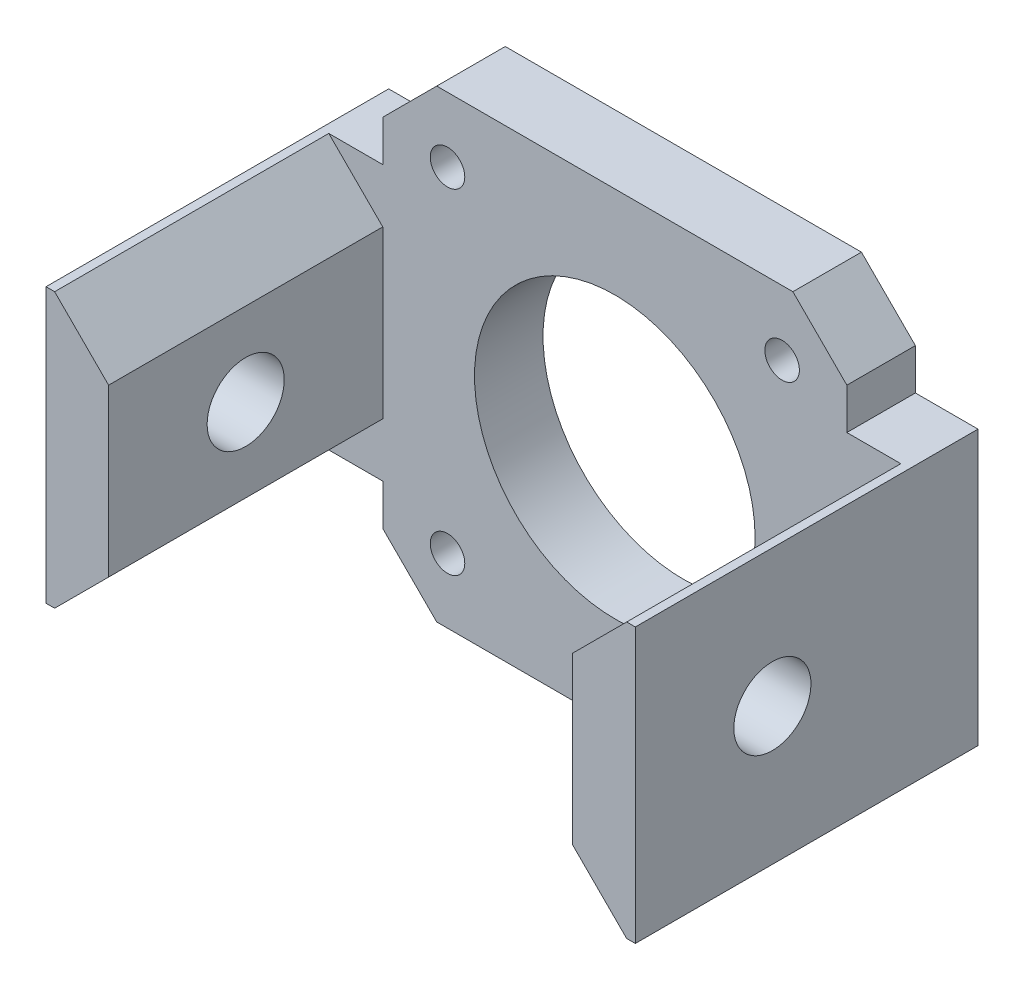
ISO-10303-21;
HEADER;
FILE_DESCRIPTION(('STEP AP214'),'2;1');
FILE_NAME('part.step','',(''),(''),'','','');
FILE_SCHEMA(('AUTOMOTIVE_DESIGN { 1 0 10303 214 1 1 1 1 }'));
ENDSEC;
DATA;
#1=APPLICATION_CONTEXT('core data for automotive mechanical design processes');
#2=APPLICATION_PROTOCOL_DEFINITION('international standard','automotive_design',2000,#1);
#3=PRODUCT_CONTEXT('',#1,'mechanical');
#4=PRODUCT('Part','Part','',(#3));
#5=PRODUCT_RELATED_PRODUCT_CATEGORY('part','',(#4));
#6=PRODUCT_DEFINITION_FORMATION('','',#4);
#7=PRODUCT_DEFINITION_CONTEXT('part definition',#1,'design');
#8=PRODUCT_DEFINITION('design','',#6,#7);
#9=PRODUCT_DEFINITION_SHAPE('','',#8);
#10=(LENGTH_UNIT() NAMED_UNIT(*) SI_UNIT(.MILLI.,.METRE.));
#11=(NAMED_UNIT(*) PLANE_ANGLE_UNIT() SI_UNIT($,.RADIAN.));
#12=(NAMED_UNIT(*) SI_UNIT($,.STERADIAN.) SOLID_ANGLE_UNIT());
#13=UNCERTAINTY_MEASURE_WITH_UNIT(LENGTH_MEASURE(1.E-05),#10,'distance_accuracy_value','');
#14=(GEOMETRIC_REPRESENTATION_CONTEXT(3) GLOBAL_UNCERTAINTY_ASSIGNED_CONTEXT((#13)) GLOBAL_UNIT_ASSIGNED_CONTEXT((#10,
#11,#12)) REPRESENTATION_CONTEXT('',''));
#15=CARTESIAN_POINT('',(0.,0.,0.));
#16=DIRECTION('',(0.,0.,1.));
#17=DIRECTION('',(1.,0.,0.));
#18=AXIS2_PLACEMENT_3D('',#15,#16,#17);
#19=CARTESIAN_POINT('',(0.,0.,6.35));
#20=DIRECTION('',(0.,0.,1.));
#21=DIRECTION('',(1.,0.,0.));
#22=AXIS2_PLACEMENT_3D('',#19,#20,#21);
#23=PLANE('',#22);
#24=DIRECTION('',(-0.707106781186547,-0.707106781186548,0.));
#25=VECTOR('',#24,1.);
#26=CARTESIAN_POINT('',(19.,-19.,6.35));
#27=LINE('',#26,#25);
#28=CARTESIAN_POINT('',(21.5,-16.5,6.35));
#29=VERTEX_POINT('',#28);
#30=CARTESIAN_POINT('',(16.5,-21.5,6.35));
#31=VERTEX_POINT('',#30);
#32=EDGE_CURVE('E355',#29,#31,#27,.T.);
#33=ORIENTED_EDGE('',*,*,#32,.F.);
#34=DIRECTION('',(0.,1.,0.));
#35=VECTOR('',#34,1.);
#36=CARTESIAN_POINT('',(21.5,0.,6.35));
#37=LINE('',#36,#35);
#38=CARTESIAN_POINT('',(21.5,-12.7,6.35));
#39=VERTEX_POINT('',#38);
#40=EDGE_CURVE('E349',#29,#39,#37,.T.);
#41=ORIENTED_EDGE('',*,*,#40,.T.);
#42=DIRECTION('',(-1.,0.,0.));
#43=VECTOR('',#42,1.);
#44=CARTESIAN_POINT('',(0.,-12.7,6.35));
#45=LINE('',#44,#43);
#46=CARTESIAN_POINT('',(26.5,-12.7,6.35));
#47=VERTEX_POINT('',#46);
#48=EDGE_CURVE('E444',#47,#39,#45,.T.);
#49=ORIENTED_EDGE('',*,*,#48,.F.);
#50=DIRECTION('',(0.707106781186549,-0.707106781186547,0.));
#51=VECTOR('',#50,1.);
#52=CARTESIAN_POINT('',(21.5,-7.7,6.35));
#53=LINE('',#52,#51);
#54=CARTESIAN_POINT('',(21.5,-7.7,6.35));
#55=VERTEX_POINT('',#54);
#56=EDGE_CURVE('E471',#47,#55,#53,.F.);
#57=ORIENTED_EDGE('',*,*,#56,.T.);
#58=DIRECTION('',(0.,-1.,0.));
#59=VECTOR('',#58,1.);
#60=CARTESIAN_POINT('',(21.5,-21.5,6.35));
#61=LINE('',#60,#59);
#62=CARTESIAN_POINT('',(21.5,7.69999999999999,6.35));
#63=VERTEX_POINT('',#62);
#64=EDGE_CURVE('E366',#63,#55,#61,.T.);
#65=ORIENTED_EDGE('',*,*,#64,.F.);
#66=DIRECTION('',(0.707106781186547,0.707106781186549,0.));
#67=VECTOR('',#66,1.);
#68=CARTESIAN_POINT('',(26.5,12.7,6.35));
#69=LINE('',#68,#67);
#70=CARTESIAN_POINT('',(26.5,12.7,6.35));
#71=VERTEX_POINT('',#70);
#72=EDGE_CURVE('E473',#63,#71,#69,.T.);
#73=ORIENTED_EDGE('',*,*,#72,.T.);
#74=DIRECTION('',(1.,0.,0.));
#75=VECTOR('',#74,1.);
#76=CARTESIAN_POINT('',(27.3,12.7,6.35));
#77=LINE('',#76,#75);
#78=CARTESIAN_POINT('',(21.5,12.7,6.35));
#79=VERTEX_POINT('',#78);
#80=EDGE_CURVE('E108',#79,#71,#77,.T.);
#81=ORIENTED_EDGE('',*,*,#80,.F.);
#82=DIRECTION('',(0.,-1.,0.));
#83=VECTOR('',#82,1.);
#84=CARTESIAN_POINT('',(21.5,0.,6.35));
#85=LINE('',#84,#83);
#86=CARTESIAN_POINT('',(21.5,16.5,6.35));
#87=VERTEX_POINT('',#86);
#88=EDGE_CURVE('E340',#87,#79,#85,.T.);
#89=ORIENTED_EDGE('',*,*,#88,.F.);
#90=DIRECTION('',(-0.707106781186547,0.707106781186548,0.));
#91=VECTOR('',#90,1.);
#92=CARTESIAN_POINT('',(19.,19.,6.35));
#93=LINE('',#92,#91);
#94=CARTESIAN_POINT('',(16.5,21.5,6.35));
#95=VERTEX_POINT('',#94);
#96=EDGE_CURVE('E352',#87,#95,#93,.T.);
#97=ORIENTED_EDGE('',*,*,#96,.T.);
#98=DIRECTION('',(-1.,0.,0.));
#99=VECTOR('',#98,1.);
#100=CARTESIAN_POINT('',(-21.5,21.5,6.35));
#101=LINE('',#100,#99);
#102=CARTESIAN_POINT('',(-16.5,21.5,6.35));
#103=VERTEX_POINT('',#102);
#104=EDGE_CURVE('E415',#95,#103,#101,.T.);
#105=ORIENTED_EDGE('',*,*,#104,.T.);
#106=DIRECTION('',(0.707106781186547,0.707106781186548,0.));
#107=VECTOR('',#106,1.);
#108=CARTESIAN_POINT('',(-19.,19.,6.35));
#109=LINE('',#108,#107);
#110=CARTESIAN_POINT('',(-21.5,16.5,6.35));
#111=VERTEX_POINT('',#110);
#112=EDGE_CURVE('E364',#111,#103,#109,.T.);
#113=ORIENTED_EDGE('',*,*,#112,.F.);
#114=DIRECTION('',(0.,-1.,0.));
#115=VECTOR('',#114,1.);
#116=CARTESIAN_POINT('',(-21.5,0.,6.35));
#117=LINE('',#116,#115);
#118=CARTESIAN_POINT('',(-21.5,12.7,6.35));
#119=VERTEX_POINT('',#118);
#120=EDGE_CURVE('E358',#111,#119,#117,.T.);
#121=ORIENTED_EDGE('',*,*,#120,.T.);
#122=DIRECTION('',(1.,0.,0.));
#123=VECTOR('',#122,1.);
#124=CARTESIAN_POINT('',(0.,12.7,6.35));
#125=LINE('',#124,#123);
#126=CARTESIAN_POINT('',(-26.5,12.7,6.35));
#127=VERTEX_POINT('',#126);
#128=EDGE_CURVE('E466',#127,#119,#125,.T.);
#129=ORIENTED_EDGE('',*,*,#128,.F.);
#130=DIRECTION('',(-0.707106781186549,0.707106781186547,0.));
#131=VECTOR('',#130,1.);
#132=CARTESIAN_POINT('',(-21.5,7.7,6.35));
#133=LINE('',#132,#131);
#134=CARTESIAN_POINT('',(-21.5,7.7,6.35));
#135=VERTEX_POINT('',#134);
#136=EDGE_CURVE('E12',#127,#135,#133,.F.);
#137=ORIENTED_EDGE('',*,*,#136,.T.);
#138=DIRECTION('',(0.,1.,0.));
#139=VECTOR('',#138,1.);
#140=CARTESIAN_POINT('',(-21.5,21.5,6.35));
#141=LINE('',#140,#139);
#142=CARTESIAN_POINT('',(-21.5,-7.69999999999998,6.35));
#143=VERTEX_POINT('',#142);
#144=EDGE_CURVE('E373',#143,#135,#141,.T.);
#145=ORIENTED_EDGE('',*,*,#144,.F.);
#146=DIRECTION('',(-0.707106781186547,-0.707106781186549,0.));
#147=VECTOR('',#146,1.);
#148=CARTESIAN_POINT('',(-26.5,-12.7,6.35));
#149=LINE('',#148,#147);
#150=CARTESIAN_POINT('',(-26.5,-12.7,6.35));
#151=VERTEX_POINT('',#150);
#152=EDGE_CURVE('E94',#143,#151,#149,.T.);
#153=ORIENTED_EDGE('',*,*,#152,.T.);
#154=DIRECTION('',(-1.,0.,0.));
#155=VECTOR('',#154,1.);
#156=CARTESIAN_POINT('',(-27.3,-12.7,6.35));
#157=LINE('',#156,#155);
#158=CARTESIAN_POINT('',(-21.5,-12.7,6.35));
#159=VERTEX_POINT('',#158);
#160=EDGE_CURVE('E101',#159,#151,#157,.T.);
#161=ORIENTED_EDGE('',*,*,#160,.F.);
#162=DIRECTION('',(0.,1.,0.));
#163=VECTOR('',#162,1.);
#164=CARTESIAN_POINT('',(-21.5,0.,6.35));
#165=LINE('',#164,#163);
#166=CARTESIAN_POINT('',(-21.5,-16.5,6.35));
#167=VERTEX_POINT('',#166);
#168=EDGE_CURVE('E265',#167,#159,#165,.T.);
#169=ORIENTED_EDGE('',*,*,#168,.F.);
#170=DIRECTION('',(0.707106781186547,-0.707106781186548,0.));
#171=VECTOR('',#170,1.);
#172=CARTESIAN_POINT('',(-19.,-19.,6.35));
#173=LINE('',#172,#171);
#174=CARTESIAN_POINT('',(-16.5,-21.5,6.35));
#175=VERTEX_POINT('',#174);
#176=EDGE_CURVE('E361',#167,#175,#173,.T.);
#177=ORIENTED_EDGE('',*,*,#176,.T.);
#178=DIRECTION('',(1.,0.,0.));
#179=VECTOR('',#178,1.);
#180=CARTESIAN_POINT('',(-21.5,-21.5,6.35));
#181=LINE('',#180,#179);
#182=EDGE_CURVE('E418',#175,#31,#181,.T.);
#183=ORIENTED_EDGE('',*,*,#182,.T.);
#184=EDGE_LOOP('',(#33,#41,#49,#57,#65,#73,#81,#89,#97,#105,#113,#121,#129,#137,#145,#153,#161,
#169,#177,#183));
#185=FACE_BOUND('',#184,.T.);
#186=CARTESIAN_POINT('',(15.5000000000002,-15.5000000000002,6.35));
#187=DIRECTION('',(0.,0.,1.));
#188=DIRECTION('',(1.,0.,0.));
#189=AXIS2_PLACEMENT_3D('',#186,#187,#188);
#190=CIRCLE('',#189,1.60000000000012);
#191=CARTESIAN_POINT('',(17.1000000000003,-15.5000000000002,6.35));
#192=VERTEX_POINT('',#191);
#193=EDGE_CURVE('E391',#192,#192,#190,.T.);
#194=ORIENTED_EDGE('',*,*,#193,.F.);
#195=EDGE_LOOP('',(#194));
#196=FACE_BOUND('',#195,.T.);
#197=CARTESIAN_POINT('',(-15.5000000000002,15.4999999999999,6.35));
#198=DIRECTION('',(0.,0.,1.));
#199=DIRECTION('',(1.,0.,0.));
#200=AXIS2_PLACEMENT_3D('',#197,#198,#199);
#201=CIRCLE('',#200,1.60000000000008);
#202=CARTESIAN_POINT('',(-13.9000000000001,15.4999999999999,6.35));
#203=VERTEX_POINT('',#202);
#204=EDGE_CURVE('E403',#203,#203,#201,.T.);
#205=ORIENTED_EDGE('',*,*,#204,.F.);
#206=EDGE_LOOP('',(#205));
#207=FACE_BOUND('',#206,.T.);
#208=CARTESIAN_POINT('',(0.,0.,6.35));
#209=DIRECTION('',(0.,0.,1.));
#210=DIRECTION('',(1.,0.,0.));
#211=AXIS2_PLACEMENT_3D('',#208,#209,#210);
#212=CIRCLE('',#211,13.);
#213=CARTESIAN_POINT('',(13.,0.,6.35));
#214=VERTEX_POINT('',#213);
#215=EDGE_CURVE('E409',#214,#214,#212,.T.);
#216=ORIENTED_EDGE('',*,*,#215,.F.);
#217=EDGE_LOOP('',(#216));
#218=FACE_BOUND('',#217,.T.);
#219=CARTESIAN_POINT('',(15.4999999999999,15.4999999999999,6.35));
#220=DIRECTION('',(0.,0.,1.));
#221=DIRECTION('',(1.,0.,0.));
#222=AXIS2_PLACEMENT_3D('',#219,#220,#221);
#223=CIRCLE('',#222,1.60000000000001);
#224=CARTESIAN_POINT('',(17.0999999999999,15.4999999999999,6.35));
#225=VERTEX_POINT('',#224);
#226=EDGE_CURVE('E397',#225,#225,#223,.T.);
#227=ORIENTED_EDGE('',*,*,#226,.F.);
#228=EDGE_LOOP('',(#227));
#229=FACE_BOUND('',#228,.T.);
#230=CARTESIAN_POINT('',(-15.5000000000001,-15.5000000000002,6.35));
#231=DIRECTION('',(0.,0.,1.));
#232=DIRECTION('',(1.,0.,0.));
#233=AXIS2_PLACEMENT_3D('',#230,#231,#232);
#234=CIRCLE('',#233,1.6);
#235=CARTESIAN_POINT('',(-13.9000000000001,-15.5000000000002,6.35));
#236=VERTEX_POINT('',#235);
#237=EDGE_CURVE('E385',#236,#236,#234,.T.);
#238=ORIENTED_EDGE('',*,*,#237,.F.);
#239=EDGE_LOOP('',(#238));
#240=FACE_BOUND('',#239,.T.);
#241=ADVANCED_FACE('F86',(#185,#196,#207,#218,#229,#240),#23,.T.);
#242=CARTESIAN_POINT('',(0.,0.,0.));
#243=DIRECTION('',(0.,0.,1.));
#244=DIRECTION('',(1.,0.,0.));
#245=AXIS2_PLACEMENT_3D('',#242,#243,#244);
#246=PLANE('',#245);
#247=CARTESIAN_POINT('',(0.,0.,0.));
#248=DIRECTION('',(0.,0.,1.));
#249=DIRECTION('',(1.,0.,0.));
#250=AXIS2_PLACEMENT_3D('',#247,#248,#249);
#251=CIRCLE('',#250,13.);
#252=CARTESIAN_POINT('',(13.,0.,0.));
#253=VERTEX_POINT('',#252);
#254=EDGE_CURVE('E406',#253,#253,#251,.T.);
#255=ORIENTED_EDGE('',*,*,#254,.T.);
#256=EDGE_LOOP('',(#255));
#257=FACE_BOUND('',#256,.T.);
#258=CARTESIAN_POINT('',(-15.5000000000002,15.4999999999999,0.));
#259=DIRECTION('',(0.,0.,1.));
#260=DIRECTION('',(1.,0.,0.));
#261=AXIS2_PLACEMENT_3D('',#258,#259,#260);
#262=CIRCLE('',#261,1.60000000000008);
#263=CARTESIAN_POINT('',(-13.9000000000001,15.4999999999999,0.));
#264=VERTEX_POINT('',#263);
#265=EDGE_CURVE('E400',#264,#264,#262,.T.);
#266=ORIENTED_EDGE('',*,*,#265,.T.);
#267=EDGE_LOOP('',(#266));
#268=FACE_BOUND('',#267,.T.);
#269=CARTESIAN_POINT('',(15.4999999999999,15.4999999999999,0.));
#270=DIRECTION('',(0.,0.,1.));
#271=DIRECTION('',(1.,0.,0.));
#272=AXIS2_PLACEMENT_3D('',#269,#270,#271);
#273=CIRCLE('',#272,1.60000000000001);
#274=CARTESIAN_POINT('',(17.0999999999999,15.4999999999999,0.));
#275=VERTEX_POINT('',#274);
#276=EDGE_CURVE('E394',#275,#275,#273,.T.);
#277=ORIENTED_EDGE('',*,*,#276,.T.);
#278=EDGE_LOOP('',(#277));
#279=FACE_BOUND('',#278,.T.);
#280=CARTESIAN_POINT('',(15.5000000000002,-15.5000000000002,0.));
#281=DIRECTION('',(0.,0.,1.));
#282=DIRECTION('',(1.,0.,0.));
#283=AXIS2_PLACEMENT_3D('',#280,#281,#282);
#284=CIRCLE('',#283,1.60000000000012);
#285=CARTESIAN_POINT('',(17.1000000000003,-15.5000000000002,0.));
#286=VERTEX_POINT('',#285);
#287=EDGE_CURVE('E388',#286,#286,#284,.T.);
#288=ORIENTED_EDGE('',*,*,#287,.T.);
#289=EDGE_LOOP('',(#288));
#290=FACE_BOUND('',#289,.T.);
#291=CARTESIAN_POINT('',(-15.5000000000001,-15.5000000000002,0.));
#292=DIRECTION('',(0.,0.,1.));
#293=DIRECTION('',(1.,0.,0.));
#294=AXIS2_PLACEMENT_3D('',#291,#292,#293);
#295=CIRCLE('',#294,1.6);
#296=CARTESIAN_POINT('',(-13.9000000000001,-15.5000000000002,0.));
#297=VERTEX_POINT('',#296);
#298=EDGE_CURVE('E382',#297,#297,#295,.T.);
#299=ORIENTED_EDGE('',*,*,#298,.T.);
#300=EDGE_LOOP('',(#299));
#301=FACE_BOUND('',#300,.T.);
#302=DIRECTION('',(0.,1.,0.));
#303=VECTOR('',#302,1.);
#304=CARTESIAN_POINT('',(21.5,-16.5,0.));
#305=LINE('',#304,#303);
#306=CARTESIAN_POINT('',(21.5,-16.5,0.));
#307=VERTEX_POINT('',#306);
#308=CARTESIAN_POINT('',(21.5,-12.7,0.));
#309=VERTEX_POINT('',#308);
#310=EDGE_CURVE('E298',#307,#309,#305,.T.);
#311=ORIENTED_EDGE('',*,*,#310,.F.);
#312=DIRECTION('',(-0.707106781186547,-0.707106781186548,0.));
#313=VECTOR('',#312,1.);
#314=CARTESIAN_POINT('',(21.5,-16.5,0.));
#315=LINE('',#314,#313);
#316=CARTESIAN_POINT('',(16.5,-21.5,0.));
#317=VERTEX_POINT('',#316);
#318=EDGE_CURVE('E300',#307,#317,#315,.T.);
#319=ORIENTED_EDGE('',*,*,#318,.T.);
#320=DIRECTION('',(1.,0.,0.));
#321=VECTOR('',#320,1.);
#322=CARTESIAN_POINT('',(21.5,-21.5,0.));
#323=LINE('',#322,#321);
#324=CARTESIAN_POINT('',(-16.5,-21.5,0.));
#325=VERTEX_POINT('',#324);
#326=EDGE_CURVE('E424',#325,#317,#323,.T.);
#327=ORIENTED_EDGE('',*,*,#326,.F.);
#328=DIRECTION('',(0.707106781186547,-0.707106781186548,0.));
#329=VECTOR('',#328,1.);
#330=CARTESIAN_POINT('',(-19.,-19.,0.));
#331=LINE('',#330,#329);
#332=CARTESIAN_POINT('',(-21.5,-16.5,0.));
#333=VERTEX_POINT('',#332);
#334=EDGE_CURVE('E270',#333,#325,#331,.T.);
#335=ORIENTED_EDGE('',*,*,#334,.F.);
#336=DIRECTION('',(0.,1.,0.));
#337=VECTOR('',#336,1.);
#338=CARTESIAN_POINT('',(-21.5,-16.5,0.));
#339=LINE('',#338,#337);
#340=CARTESIAN_POINT('',(-21.5,-12.7,0.));
#341=VERTEX_POINT('',#340);
#342=EDGE_CURVE('E258',#333,#341,#339,.T.);
#343=ORIENTED_EDGE('',*,*,#342,.T.);
#344=DIRECTION('',(1.,0.,0.));
#345=VECTOR('',#344,1.);
#346=CARTESIAN_POINT('',(-27.3,-12.7,0.));
#347=LINE('',#346,#345);
#348=CARTESIAN_POINT('',(-27.3,-12.7,0.));
#349=VERTEX_POINT('',#348);
#350=EDGE_CURVE('E246',#349,#341,#347,.T.);
#351=ORIENTED_EDGE('',*,*,#350,.F.);
#352=DIRECTION('',(0.,-1.,0.));
#353=VECTOR('',#352,1.);
#354=CARTESIAN_POINT('',(-27.3,21.5,0.));
#355=LINE('',#354,#353);
#356=CARTESIAN_POINT('',(-27.3,12.7,0.));
#357=VERTEX_POINT('',#356);
#358=EDGE_CURVE('E412',#357,#349,#355,.T.);
#359=ORIENTED_EDGE('',*,*,#358,.F.);
#360=DIRECTION('',(1.,0.,0.));
#361=VECTOR('',#360,1.);
#362=CARTESIAN_POINT('',(-27.3,12.7,0.));
#363=LINE('',#362,#361);
#364=CARTESIAN_POINT('',(-21.5,12.7,0.));
#365=VERTEX_POINT('',#364);
#366=EDGE_CURVE('E320',#357,#365,#363,.T.);
#367=ORIENTED_EDGE('',*,*,#366,.T.);
#368=DIRECTION('',(0.,-1.,0.));
#369=VECTOR('',#368,1.);
#370=CARTESIAN_POINT('',(-21.5,16.5,0.));
#371=LINE('',#370,#369);
#372=CARTESIAN_POINT('',(-21.5,16.5,0.));
#373=VERTEX_POINT('',#372);
#374=EDGE_CURVE('E323',#373,#365,#371,.T.);
#375=ORIENTED_EDGE('',*,*,#374,.F.);
#376=DIRECTION('',(0.707106781186547,0.707106781186548,0.));
#377=VECTOR('',#376,1.);
#378=CARTESIAN_POINT('',(-21.5,16.5,0.));
#379=LINE('',#378,#377);
#380=CARTESIAN_POINT('',(-16.5,21.5,0.));
#381=VERTEX_POINT('',#380);
#382=EDGE_CURVE('E317',#373,#381,#379,.T.);
#383=ORIENTED_EDGE('',*,*,#382,.T.);
#384=DIRECTION('',(-1.,0.,0.));
#385=VECTOR('',#384,1.);
#386=CARTESIAN_POINT('',(-21.5,21.5,0.));
#387=LINE('',#386,#385);
#388=CARTESIAN_POINT('',(16.5,21.5,0.));
#389=VERTEX_POINT('',#388);
#390=EDGE_CURVE('E419',#389,#381,#387,.T.);
#391=ORIENTED_EDGE('',*,*,#390,.F.);
#392=DIRECTION('',(-0.707106781186547,0.707106781186548,0.));
#393=VECTOR('',#392,1.);
#394=CARTESIAN_POINT('',(21.5,16.5,0.));
#395=LINE('',#394,#393);
#396=CARTESIAN_POINT('',(21.5,16.5,0.));
#397=VERTEX_POINT('',#396);
#398=EDGE_CURVE('E329',#397,#389,#395,.T.);
#399=ORIENTED_EDGE('',*,*,#398,.F.);
#400=DIRECTION('',(0.,-1.,0.));
#401=VECTOR('',#400,1.);
#402=CARTESIAN_POINT('',(21.5,16.5,0.));
#403=LINE('',#402,#401);
#404=CARTESIAN_POINT('',(21.5,12.7,0.));
#405=VERTEX_POINT('',#404);
#406=EDGE_CURVE('E331',#397,#405,#403,.T.);
#407=ORIENTED_EDGE('',*,*,#406,.T.);
#408=DIRECTION('',(-1.,0.,0.));
#409=VECTOR('',#408,1.);
#410=CARTESIAN_POINT('',(27.3,12.7,0.));
#411=LINE('',#410,#409);
#412=CARTESIAN_POINT('',(27.3,12.7,0.));
#413=VERTEX_POINT('',#412);
#414=EDGE_CURVE('E334',#413,#405,#411,.T.);
#415=ORIENTED_EDGE('',*,*,#414,.F.);
#416=DIRECTION('',(0.,1.,0.));
#417=VECTOR('',#416,1.);
#418=CARTESIAN_POINT('',(27.3,-21.5,0.));
#419=LINE('',#418,#417);
#420=CARTESIAN_POINT('',(27.3,-12.7,0.));
#421=VERTEX_POINT('',#420);
#422=EDGE_CURVE('E427',#421,#413,#419,.T.);
#423=ORIENTED_EDGE('',*,*,#422,.F.);
#424=DIRECTION('',(-1.,0.,0.));
#425=VECTOR('',#424,1.);
#426=CARTESIAN_POINT('',(27.3,-12.7,0.));
#427=LINE('',#426,#425);
#428=EDGE_CURVE('E295',#421,#309,#427,.T.);
#429=ORIENTED_EDGE('',*,*,#428,.T.);
#430=EDGE_LOOP('',(#311,#319,#327,#335,#343,#351,#359,#367,#375,#383,#391,#399,#407,#415,#423,#429));
#431=FACE_BOUND('',#430,.T.);
#432=ADVANCED_FACE('F268',(#257,#268,#279,#290,#301,#431),#246,.F.);
#433=CARTESIAN_POINT('',(-27.3,21.5,6.35));
#434=DIRECTION('',(1.,0.,0.));
#435=DIRECTION('',(0.,1.,0.));
#436=AXIS2_PLACEMENT_3D('',#433,#434,#435);
#437=PLANE('',#436);
#438=CARTESIAN_POINT('',(-27.3,0.,19.05));
#439=DIRECTION('',(1.,0.,0.));
#440=DIRECTION('',(0.,1.,0.));
#441=AXIS2_PLACEMENT_3D('',#438,#439,#440);
#442=CIRCLE('',#441,3.571875);
#443=CARTESIAN_POINT('',(-27.3,3.571875,19.05));
#444=VERTEX_POINT('',#443);
#445=EDGE_CURVE('E435',#444,#444,#442,.T.);
#446=ORIENTED_EDGE('',*,*,#445,.T.);
#447=EDGE_LOOP('',(#446));
#448=FACE_BOUND('',#447,.T.);
#449=DIRECTION('',(0.,-1.,0.));
#450=VECTOR('',#449,1.);
#451=CARTESIAN_POINT('',(-27.3,-21.5,31.75));
#452=LINE('',#451,#450);
#453=CARTESIAN_POINT('',(-27.3,12.7,31.75));
#454=VERTEX_POINT('',#453);
#455=CARTESIAN_POINT('',(-27.3,-12.7,31.75));
#456=VERTEX_POINT('',#455);
#457=EDGE_CURVE('E376',#454,#456,#452,.T.);
#458=ORIENTED_EDGE('',*,*,#457,.F.);
#459=DIRECTION('',(0.,0.,1.));
#460=VECTOR('',#459,1.);
#461=CARTESIAN_POINT('',(-27.3,12.7,0.));
#462=LINE('',#461,#460);
#463=EDGE_CURVE('E309',#357,#454,#462,.T.);
#464=ORIENTED_EDGE('',*,*,#463,.F.);
#465=ORIENTED_EDGE('',*,*,#358,.T.);
#466=DIRECTION('',(0.,0.,1.));
#467=VECTOR('',#466,1.);
#468=CARTESIAN_POINT('',(-27.3,-12.7,0.));
#469=LINE('',#468,#467);
#470=EDGE_CURVE('E252',#349,#456,#469,.T.);
#471=ORIENTED_EDGE('',*,*,#470,.T.);
#472=EDGE_LOOP('',(#458,#464,#465,#471));
#473=FACE_BOUND('',#472,.T.);
#474=ADVANCED_FACE('F498',(#448,#473),#437,.F.);
#475=CARTESIAN_POINT('',(21.5,-21.5,6.35));
#476=DIRECTION('',(0.,1.,0.));
#477=DIRECTION('',(0.,0.,1.));
#478=AXIS2_PLACEMENT_3D('',#475,#476,#477);
#479=PLANE('',#478);
#480=ORIENTED_EDGE('',*,*,#326,.T.);
#481=DIRECTION('',(0.,0.,1.));
#482=VECTOR('',#481,1.);
#483=CARTESIAN_POINT('',(16.5,-21.5,0.));
#484=LINE('',#483,#482);
#485=EDGE_CURVE('E283',#317,#31,#484,.T.);
#486=ORIENTED_EDGE('',*,*,#485,.T.);
#487=ORIENTED_EDGE('',*,*,#182,.F.);
#488=DIRECTION('',(0.,0.,1.));
#489=VECTOR('',#488,1.);
#490=CARTESIAN_POINT('',(-16.5,-21.5,0.));
#491=LINE('',#490,#489);
#492=EDGE_CURVE('E279',#325,#175,#491,.T.);
#493=ORIENTED_EDGE('',*,*,#492,.F.);
#494=EDGE_LOOP('',(#480,#486,#487,#493));
#495=FACE_BOUND('',#494,.T.);
#496=ADVANCED_FACE('F573',(#495),#479,.F.);
#497=CARTESIAN_POINT('',(27.3,-21.5,6.35));
#498=DIRECTION('',(-1.,0.,0.));
#499=DIRECTION('',(0.,0.,1.));
#500=AXIS2_PLACEMENT_3D('',#497,#498,#499);
#501=PLANE('',#500);
#502=CARTESIAN_POINT('',(27.3,0.,19.05));
#503=DIRECTION('',(1.,0.,0.));
#504=DIRECTION('',(0.,1.,0.));
#505=AXIS2_PLACEMENT_3D('',#502,#503,#504);
#506=CIRCLE('',#505,3.571875);
#507=CARTESIAN_POINT('',(27.3,3.57187500000001,19.05));
#508=VERTEX_POINT('',#507);
#509=EDGE_CURVE('E896',#508,#508,#506,.T.);
#510=ORIENTED_EDGE('',*,*,#509,.F.);
#511=EDGE_LOOP('',(#510));
#512=FACE_BOUND('',#511,.T.);
#513=DIRECTION('',(0.,1.,0.));
#514=VECTOR('',#513,1.);
#515=CARTESIAN_POINT('',(27.3,21.5,31.75));
#516=LINE('',#515,#514);
#517=CARTESIAN_POINT('',(27.3,-12.7,31.75));
#518=VERTEX_POINT('',#517);
#519=CARTESIAN_POINT('',(27.3,12.7,31.75));
#520=VERTEX_POINT('',#519);
#521=EDGE_CURVE('E370',#518,#520,#516,.T.);
#522=ORIENTED_EDGE('',*,*,#521,.F.);
#523=DIRECTION('',(0.,0.,1.));
#524=VECTOR('',#523,1.);
#525=CARTESIAN_POINT('',(27.3,-12.7,0.));
#526=LINE('',#525,#524);
#527=EDGE_CURVE('E293',#421,#518,#526,.T.);
#528=ORIENTED_EDGE('',*,*,#527,.F.);
#529=ORIENTED_EDGE('',*,*,#422,.T.);
#530=DIRECTION('',(0.,0.,1.));
#531=VECTOR('',#530,1.);
#532=CARTESIAN_POINT('',(27.3,12.7,0.));
#533=LINE('',#532,#531);
#534=EDGE_CURVE('E337',#413,#520,#533,.T.);
#535=ORIENTED_EDGE('',*,*,#534,.T.);
#536=EDGE_LOOP('',(#522,#528,#529,#535));
#537=FACE_BOUND('',#536,.T.);
#538=ADVANCED_FACE('F524',(#512,#537),#501,.F.);
#539=CARTESIAN_POINT('',(-21.5,21.5,6.35));
#540=DIRECTION('',(0.,-1.,0.));
#541=DIRECTION('',(0.,0.,-1.));
#542=AXIS2_PLACEMENT_3D('',#539,#540,#541);
#543=PLANE('',#542);
#544=ORIENTED_EDGE('',*,*,#390,.T.);
#545=DIRECTION('',(0.,0.,1.));
#546=VECTOR('',#545,1.);
#547=CARTESIAN_POINT('',(-16.5,21.5,0.));
#548=LINE('',#547,#546);
#549=EDGE_CURVE('E311',#381,#103,#548,.T.);
#550=ORIENTED_EDGE('',*,*,#549,.T.);
#551=ORIENTED_EDGE('',*,*,#104,.F.);
#552=DIRECTION('',(0.,0.,1.));
#553=VECTOR('',#552,1.);
#554=CARTESIAN_POINT('',(16.5,21.5,0.));
#555=LINE('',#554,#553);
#556=EDGE_CURVE('E336',#389,#95,#555,.T.);
#557=ORIENTED_EDGE('',*,*,#556,.F.);
#558=EDGE_LOOP('',(#544,#550,#551,#557));
#559=FACE_BOUND('',#558,.T.);
#560=ADVANCED_FACE('F509',(#559),#543,.F.);
#561=CARTESIAN_POINT('',(-21.5,21.5,31.75));
#562=DIRECTION('',(-1.,0.,0.));
#563=DIRECTION('',(0.,-1.,0.));
#564=AXIS2_PLACEMENT_3D('',#561,#562,#563);
#565=PLANE('',#564);
#566=CARTESIAN_POINT('',(-21.5,0.,19.05));
#567=DIRECTION('',(-1.,0.,0.));
#568=DIRECTION('',(0.,-1.,0.));
#569=AXIS2_PLACEMENT_3D('',#566,#567,#568);
#570=CIRCLE('',#569,3.571875);
#571=CARTESIAN_POINT('',(-21.5,-3.571875,19.05));
#572=VERTEX_POINT('',#571);
#573=EDGE_CURVE('E281',#572,#572,#570,.T.);
#574=ORIENTED_EDGE('',*,*,#573,.T.);
#575=EDGE_LOOP('',(#574));
#576=FACE_BOUND('',#575,.T.);
#577=DIRECTION('',(0.,1.,0.));
#578=VECTOR('',#577,1.);
#579=CARTESIAN_POINT('',(-21.5,21.5,31.75));
#580=LINE('',#579,#578);
#581=CARTESIAN_POINT('',(-21.5,-7.69999999999998,31.75));
#582=VERTEX_POINT('',#581);
#583=CARTESIAN_POINT('',(-21.5,7.7,31.75));
#584=VERTEX_POINT('',#583);
#585=EDGE_CURVE('E379',#582,#584,#580,.T.);
#586=ORIENTED_EDGE('',*,*,#585,.F.);
#587=DIRECTION('',(0.,0.,-1.));
#588=VECTOR('',#587,1.);
#589=CARTESIAN_POINT('',(-21.5,-7.69999999999998,6.35));
#590=LINE('',#589,#588);
#591=EDGE_CURVE('E464',#582,#143,#590,.T.);
#592=ORIENTED_EDGE('',*,*,#591,.T.);
#593=ORIENTED_EDGE('',*,*,#144,.T.);
#594=DIRECTION('',(0.,0.,1.));
#595=VECTOR('',#594,1.);
#596=CARTESIAN_POINT('',(-21.5,7.7,31.75));
#597=LINE('',#596,#595);
#598=EDGE_CURVE('E461',#135,#584,#597,.T.);
#599=ORIENTED_EDGE('',*,*,#598,.T.);
#600=EDGE_LOOP('',(#586,#592,#593,#599));
#601=FACE_BOUND('',#600,.T.);
#602=ADVANCED_FACE('F486',(#576,#601),#565,.F.);
#603=CARTESIAN_POINT('',(0.,0.,31.75));
#604=DIRECTION('',(0.,0.,-1.));
#605=DIRECTION('',(-1.,0.,0.));
#606=AXIS2_PLACEMENT_3D('',#603,#604,#605);
#607=PLANE('',#606);
#608=DIRECTION('',(1.,0.,0.));
#609=VECTOR('',#608,1.);
#610=CARTESIAN_POINT('',(-27.3,-12.7,31.75));
#611=LINE('',#610,#609);
#612=CARTESIAN_POINT('',(-26.5,-12.7,31.75));
#613=VERTEX_POINT('',#612);
#614=EDGE_CURVE('E257',#456,#613,#611,.T.);
#615=ORIENTED_EDGE('',*,*,#614,.T.);
#616=DIRECTION('',(0.707106781186547,0.707106781186549,0.));
#617=VECTOR('',#616,1.);
#618=CARTESIAN_POINT('',(-26.5,-12.7,31.75));
#619=LINE('',#618,#617);
#620=EDGE_CURVE('E459',#613,#582,#619,.T.);
#621=ORIENTED_EDGE('',*,*,#620,.T.);
#622=ORIENTED_EDGE('',*,*,#585,.T.);
#623=DIRECTION('',(0.707106781186549,-0.707106781186547,0.));
#624=VECTOR('',#623,1.);
#625=CARTESIAN_POINT('',(-21.5,7.7,31.75));
#626=LINE('',#625,#624);
#627=CARTESIAN_POINT('',(-26.5,12.7,31.75));
#628=VERTEX_POINT('',#627);
#629=EDGE_CURVE('E457',#584,#628,#626,.F.);
#630=ORIENTED_EDGE('',*,*,#629,.T.);
#631=DIRECTION('',(1.,0.,0.));
#632=VECTOR('',#631,1.);
#633=CARTESIAN_POINT('',(-27.3,12.7,31.75));
#634=LINE('',#633,#632);
#635=EDGE_CURVE('E287',#454,#628,#634,.T.);
#636=ORIENTED_EDGE('',*,*,#635,.F.);
#637=ORIENTED_EDGE('',*,*,#457,.T.);
#638=EDGE_LOOP('',(#615,#621,#622,#630,#636,#637));
#639=FACE_BOUND('',#638,.T.);
#640=ADVANCED_FACE('F484',(#639),#607,.F.);
#641=CARTESIAN_POINT('',(21.5,-21.5,31.75));
#642=DIRECTION('',(1.,0.,0.));
#643=DIRECTION('',(0.,0.,-1.));
#644=AXIS2_PLACEMENT_3D('',#641,#642,#643);
#645=PLANE('',#644);
#646=CARTESIAN_POINT('',(21.5,0.,19.05));
#647=DIRECTION('',(1.,0.,0.));
#648=DIRECTION('',(0.,0.,-1.));
#649=AXIS2_PLACEMENT_3D('',#646,#647,#648);
#650=CIRCLE('',#649,3.571875);
#651=CARTESIAN_POINT('',(21.5,0.,15.478125));
#652=VERTEX_POINT('',#651);
#653=EDGE_CURVE('E432',#652,#652,#650,.T.);
#654=ORIENTED_EDGE('',*,*,#653,.T.);
#655=EDGE_LOOP('',(#654));
#656=FACE_BOUND('',#655,.T.);
#657=ORIENTED_EDGE('',*,*,#64,.T.);
#658=DIRECTION('',(0.,0.,1.));
#659=VECTOR('',#658,1.);
#660=CARTESIAN_POINT('',(21.5,-7.7,31.75));
#661=LINE('',#660,#659);
#662=CARTESIAN_POINT('',(21.5,-7.7,31.75));
#663=VERTEX_POINT('',#662);
#664=EDGE_CURVE('E437',#55,#663,#661,.T.);
#665=ORIENTED_EDGE('',*,*,#664,.T.);
#666=DIRECTION('',(0.,-1.,0.));
#667=VECTOR('',#666,1.);
#668=CARTESIAN_POINT('',(21.5,-21.5,31.75));
#669=LINE('',#668,#667);
#670=CARTESIAN_POINT('',(21.5,7.69999999999999,31.75));
#671=VERTEX_POINT('',#670);
#672=EDGE_CURVE('E367',#671,#663,#669,.T.);
#673=ORIENTED_EDGE('',*,*,#672,.F.);
#674=DIRECTION('',(0.,0.,-1.));
#675=VECTOR('',#674,1.);
#676=CARTESIAN_POINT('',(21.5,7.69999999999999,6.35));
#677=LINE('',#676,#675);
#678=EDGE_CURVE('E422',#671,#63,#677,.T.);
#679=ORIENTED_EDGE('',*,*,#678,.T.);
#680=EDGE_LOOP('',(#657,#665,#673,#679));
#681=FACE_BOUND('',#680,.T.);
#682=ADVANCED_FACE('F538',(#656,#681),#645,.F.);
#683=CARTESIAN_POINT('',(0.,0.,31.75));
#684=DIRECTION('',(0.,0.,-1.));
#685=DIRECTION('',(-1.,0.,0.));
#686=AXIS2_PLACEMENT_3D('',#683,#684,#685);
#687=PLANE('',#686);
#688=ORIENTED_EDGE('',*,*,#672,.T.);
#689=DIRECTION('',(-0.707106781186549,0.707106781186547,0.));
#690=VECTOR('',#689,1.);
#691=CARTESIAN_POINT('',(21.5,-7.7,31.75));
#692=LINE('',#691,#690);
#693=CARTESIAN_POINT('',(26.5,-12.7,31.75));
#694=VERTEX_POINT('',#693);
#695=EDGE_CURVE('E442',#663,#694,#692,.F.);
#696=ORIENTED_EDGE('',*,*,#695,.T.);
#697=DIRECTION('',(-1.,0.,0.));
#698=VECTOR('',#697,1.);
#699=CARTESIAN_POINT('',(27.3,-12.7,31.75));
#700=LINE('',#699,#698);
#701=EDGE_CURVE('E303',#518,#694,#700,.T.);
#702=ORIENTED_EDGE('',*,*,#701,.F.);
#703=ORIENTED_EDGE('',*,*,#521,.T.);
#704=DIRECTION('',(-1.,0.,0.));
#705=VECTOR('',#704,1.);
#706=CARTESIAN_POINT('',(27.3,12.7,31.75));
#707=LINE('',#706,#705);
#708=CARTESIAN_POINT('',(26.5,12.7,31.75));
#709=VERTEX_POINT('',#708);
#710=EDGE_CURVE('E306',#520,#709,#707,.T.);
#711=ORIENTED_EDGE('',*,*,#710,.T.);
#712=DIRECTION('',(-0.707106781186547,-0.707106781186549,0.));
#713=VECTOR('',#712,1.);
#714=CARTESIAN_POINT('',(26.5,12.7,31.75));
#715=LINE('',#714,#713);
#716=EDGE_CURVE('E440',#709,#671,#715,.T.);
#717=ORIENTED_EDGE('',*,*,#716,.T.);
#718=EDGE_LOOP('',(#688,#696,#702,#703,#711,#717));
#719=FACE_BOUND('',#718,.T.);
#720=ADVANCED_FACE('F531',(#719),#687,.F.);
#721=CARTESIAN_POINT('',(0.,0.,6.35));
#722=DIRECTION('',(0.,0.,-1.));
#723=DIRECTION('',(-1.,0.,0.));
#724=AXIS2_PLACEMENT_3D('',#721,#722,#723);
#725=CYLINDRICAL_SURFACE('',#724,13.);
#726=ORIENTED_EDGE('',*,*,#215,.T.);
#727=EDGE_LOOP('',(#726));
#728=FACE_BOUND('',#727,.T.);
#729=ORIENTED_EDGE('',*,*,#254,.F.);
#730=EDGE_LOOP('',(#729));
#731=FACE_BOUND('',#730,.T.);
#732=ADVANCED_FACE('F566',(#728,#731),#725,.F.);
#733=CARTESIAN_POINT('',(-15.5000000000002,15.4999999999999,6.35));
#734=DIRECTION('',(0.,0.,-1.));
#735=DIRECTION('',(-1.,0.,0.));
#736=AXIS2_PLACEMENT_3D('',#733,#734,#735);
#737=CYLINDRICAL_SURFACE('',#736,1.60000000000008);
#738=ORIENTED_EDGE('',*,*,#204,.T.);
#739=EDGE_LOOP('',(#738));
#740=FACE_BOUND('',#739,.T.);
#741=ORIENTED_EDGE('',*,*,#265,.F.);
#742=EDGE_LOOP('',(#741));
#743=FACE_BOUND('',#742,.T.);
#744=ADVANCED_FACE('F821',(#740,#743),#737,.F.);
#745=CARTESIAN_POINT('',(15.4999999999999,15.4999999999999,6.35));
#746=DIRECTION('',(0.,0.,-1.));
#747=DIRECTION('',(-1.,0.,0.));
#748=AXIS2_PLACEMENT_3D('',#745,#746,#747);
#749=CYLINDRICAL_SURFACE('',#748,1.60000000000001);
#750=ORIENTED_EDGE('',*,*,#226,.T.);
#751=EDGE_LOOP('',(#750));
#752=FACE_BOUND('',#751,.T.);
#753=ORIENTED_EDGE('',*,*,#276,.F.);
#754=EDGE_LOOP('',(#753));
#755=FACE_BOUND('',#754,.T.);
#756=ADVANCED_FACE('F811',(#752,#755),#749,.F.);
#757=CARTESIAN_POINT('',(15.5000000000002,-15.5000000000002,6.35));
#758=DIRECTION('',(0.,0.,-1.));
#759=DIRECTION('',(-1.,0.,0.));
#760=AXIS2_PLACEMENT_3D('',#757,#758,#759);
#761=CYLINDRICAL_SURFACE('',#760,1.60000000000012);
#762=ORIENTED_EDGE('',*,*,#193,.T.);
#763=EDGE_LOOP('',(#762));
#764=FACE_BOUND('',#763,.T.);
#765=ORIENTED_EDGE('',*,*,#287,.F.);
#766=EDGE_LOOP('',(#765));
#767=FACE_BOUND('',#766,.T.);
#768=ADVANCED_FACE('F554',(#764,#767),#761,.F.);
#769=CARTESIAN_POINT('',(-15.5000000000001,-15.5000000000002,6.35));
#770=DIRECTION('',(0.,0.,-1.));
#771=DIRECTION('',(-1.,0.,0.));
#772=AXIS2_PLACEMENT_3D('',#769,#770,#771);
#773=CYLINDRICAL_SURFACE('',#772,1.6);
#774=ORIENTED_EDGE('',*,*,#237,.T.);
#775=EDGE_LOOP('',(#774));
#776=FACE_BOUND('',#775,.T.);
#777=ORIENTED_EDGE('',*,*,#298,.F.);
#778=EDGE_LOOP('',(#777));
#779=FACE_BOUND('',#778,.T.);
#780=ADVANCED_FACE('F547',(#776,#779),#773,.F.);
#781=CARTESIAN_POINT('',(27.3,12.7,0.));
#782=DIRECTION('',(0.,1.,0.));
#783=DIRECTION('',(0.,0.,1.));
#784=AXIS2_PLACEMENT_3D('',#781,#782,#783);
#785=PLANE('',#784);
#786=ORIENTED_EDGE('',*,*,#80,.T.);
#787=DIRECTION('',(0.,0.,1.));
#788=VECTOR('',#787,1.);
#789=CARTESIAN_POINT('',(26.5,12.7,31.75));
#790=LINE('',#789,#788);
#791=EDGE_CURVE('E450',#71,#709,#790,.T.);
#792=ORIENTED_EDGE('',*,*,#791,.T.);
#793=ORIENTED_EDGE('',*,*,#710,.F.);
#794=ORIENTED_EDGE('',*,*,#534,.F.);
#795=ORIENTED_EDGE('',*,*,#414,.T.);
#796=DIRECTION('',(0.,0.,1.));
#797=VECTOR('',#796,1.);
#798=CARTESIAN_POINT('',(21.5,12.7,0.));
#799=LINE('',#798,#797);
#800=EDGE_CURVE('E341',#405,#79,#799,.T.);
#801=ORIENTED_EDGE('',*,*,#800,.T.);
#802=EDGE_LOOP('',(#786,#792,#793,#794,#795,#801));
#803=FACE_BOUND('',#802,.T.);
#804=ADVANCED_FACE('F545',(#803),#785,.T.);
#805=CARTESIAN_POINT('',(21.5,16.5,0.));
#806=DIRECTION('',(-1.,0.,0.));
#807=DIRECTION('',(0.,-1.,0.));
#808=AXIS2_PLACEMENT_3D('',#805,#806,#807);
#809=PLANE('',#808);
#810=ORIENTED_EDGE('',*,*,#88,.T.);
#811=ORIENTED_EDGE('',*,*,#800,.F.);
#812=ORIENTED_EDGE('',*,*,#406,.F.);
#813=DIRECTION('',(0.,0.,1.));
#814=VECTOR('',#813,1.);
#815=CARTESIAN_POINT('',(21.5,16.5,0.));
#816=LINE('',#815,#814);
#817=EDGE_CURVE('E343',#397,#87,#816,.T.);
#818=ORIENTED_EDGE('',*,*,#817,.T.);
#819=EDGE_LOOP('',(#810,#811,#812,#818));
#820=FACE_BOUND('',#819,.T.);
#821=ADVANCED_FACE('F515',(#820),#809,.F.);
#822=CARTESIAN_POINT('',(21.5,16.5,0.));
#823=DIRECTION('',(0.707106781186548,0.707106781186547,0.));
#824=DIRECTION('',(-0.707106781186547,0.707106781186548,0.));
#825=AXIS2_PLACEMENT_3D('',#822,#823,#824);
#826=PLANE('',#825);
#827=ORIENTED_EDGE('',*,*,#817,.F.);
#828=ORIENTED_EDGE('',*,*,#398,.T.);
#829=ORIENTED_EDGE('',*,*,#556,.T.);
#830=ORIENTED_EDGE('',*,*,#96,.F.);
#831=EDGE_LOOP('',(#827,#828,#829,#830));
#832=FACE_BOUND('',#831,.T.);
#833=ADVANCED_FACE('F512',(#832),#826,.T.);
#834=CARTESIAN_POINT('',(21.5,-16.5,0.));
#835=DIRECTION('',(-0.707106781186548,0.707106781186547,0.));
#836=DIRECTION('',(-0.707106781186547,-0.707106781186548,0.));
#837=AXIS2_PLACEMENT_3D('',#834,#835,#836);
#838=PLANE('',#837);
#839=ORIENTED_EDGE('',*,*,#32,.T.);
#840=ORIENTED_EDGE('',*,*,#485,.F.);
#841=ORIENTED_EDGE('',*,*,#318,.F.);
#842=DIRECTION('',(0.,0.,1.));
#843=VECTOR('',#842,1.);
#844=CARTESIAN_POINT('',(21.5,-16.5,0.));
#845=LINE('',#844,#843);
#846=EDGE_CURVE('E286',#307,#29,#845,.T.);
#847=ORIENTED_EDGE('',*,*,#846,.T.);
#848=EDGE_LOOP('',(#839,#840,#841,#847));
#849=FACE_BOUND('',#848,.T.);
#850=ADVANCED_FACE('F755',(#849),#838,.F.);
#851=CARTESIAN_POINT('',(21.5,-16.5,0.));
#852=DIRECTION('',(1.,0.,0.));
#853=DIRECTION('',(0.,1.,0.));
#854=AXIS2_PLACEMENT_3D('',#851,#852,#853);
#855=PLANE('',#854);
#856=ORIENTED_EDGE('',*,*,#846,.F.);
#857=ORIENTED_EDGE('',*,*,#310,.T.);
#858=DIRECTION('',(0.,0.,1.));
#859=VECTOR('',#858,1.);
#860=CARTESIAN_POINT('',(21.5,-12.7,0.));
#861=LINE('',#860,#859);
#862=EDGE_CURVE('E290',#309,#39,#861,.T.);
#863=ORIENTED_EDGE('',*,*,#862,.T.);
#864=ORIENTED_EDGE('',*,*,#40,.F.);
#865=EDGE_LOOP('',(#856,#857,#863,#864));
#866=FACE_BOUND('',#865,.T.);
#867=ADVANCED_FACE('F642',(#866),#855,.T.);
#868=CARTESIAN_POINT('',(27.3,-12.7,0.));
#869=DIRECTION('',(0.,1.,0.));
#870=DIRECTION('',(0.,0.,1.));
#871=AXIS2_PLACEMENT_3D('',#868,#869,#870);
#872=PLANE('',#871);
#873=ORIENTED_EDGE('',*,*,#701,.T.);
#874=DIRECTION('',(0.,0.,-1.));
#875=VECTOR('',#874,1.);
#876=CARTESIAN_POINT('',(26.5,-12.7,0.));
#877=LINE('',#876,#875);
#878=EDGE_CURVE('E446',#694,#47,#877,.T.);
#879=ORIENTED_EDGE('',*,*,#878,.T.);
#880=ORIENTED_EDGE('',*,*,#48,.T.);
#881=ORIENTED_EDGE('',*,*,#862,.F.);
#882=ORIENTED_EDGE('',*,*,#428,.F.);
#883=ORIENTED_EDGE('',*,*,#527,.T.);
#884=EDGE_LOOP('',(#873,#879,#880,#881,#882,#883));
#885=FACE_BOUND('',#884,.T.);
#886=ADVANCED_FACE('F527',(#885),#872,.F.);
#887=CARTESIAN_POINT('',(-19.,-19.,0.));
#888=DIRECTION('',(-0.707106781186548,-0.707106781186547,0.));
#889=DIRECTION('',(0.707106781186547,-0.707106781186548,0.));
#890=AXIS2_PLACEMENT_3D('',#887,#888,#889);
#891=PLANE('',#890);
#892=DIRECTION('',(0.,0.,1.));
#893=VECTOR('',#892,1.);
#894=CARTESIAN_POINT('',(-21.5,-16.5,0.));
#895=LINE('',#894,#893);
#896=EDGE_CURVE('E277',#333,#167,#895,.T.);
#897=ORIENTED_EDGE('',*,*,#896,.F.);
#898=ORIENTED_EDGE('',*,*,#334,.T.);
#899=ORIENTED_EDGE('',*,*,#492,.T.);
#900=ORIENTED_EDGE('',*,*,#176,.F.);
#901=EDGE_LOOP('',(#897,#898,#899,#900));
#902=FACE_BOUND('',#901,.T.);
#903=ADVANCED_FACE('F630',(#902),#891,.T.);
#904=CARTESIAN_POINT('',(-27.3,-12.7,0.));
#905=DIRECTION('',(0.,-1.,0.));
#906=DIRECTION('',(0.,0.,-1.));
#907=AXIS2_PLACEMENT_3D('',#904,#905,#906);
#908=PLANE('',#907);
#909=ORIENTED_EDGE('',*,*,#160,.T.);
#910=DIRECTION('',(0.,0.,1.));
#911=VECTOR('',#910,1.);
#912=CARTESIAN_POINT('',(-26.5,-12.7,31.75));
#913=LINE('',#912,#911);
#914=EDGE_CURVE('E454',#151,#613,#913,.T.);
#915=ORIENTED_EDGE('',*,*,#914,.T.);
#916=ORIENTED_EDGE('',*,*,#614,.F.);
#917=ORIENTED_EDGE('',*,*,#470,.F.);
#918=ORIENTED_EDGE('',*,*,#350,.T.);
#919=DIRECTION('',(0.,0.,1.));
#920=VECTOR('',#919,1.);
#921=CARTESIAN_POINT('',(-21.5,-12.7,0.));
#922=LINE('',#921,#920);
#923=EDGE_CURVE('E249',#341,#159,#922,.T.);
#924=ORIENTED_EDGE('',*,*,#923,.T.);
#925=EDGE_LOOP('',(#909,#915,#916,#917,#918,#924));
#926=FACE_BOUND('',#925,.T.);
#927=ADVANCED_FACE('F248',(#926),#908,.T.);
#928=CARTESIAN_POINT('',(-21.5,-16.5,0.));
#929=DIRECTION('',(1.,0.,0.));
#930=DIRECTION('',(0.,1.,0.));
#931=AXIS2_PLACEMENT_3D('',#928,#929,#930);
#932=PLANE('',#931);
#933=ORIENTED_EDGE('',*,*,#168,.T.);
#934=ORIENTED_EDGE('',*,*,#923,.F.);
#935=ORIENTED_EDGE('',*,*,#342,.F.);
#936=ORIENTED_EDGE('',*,*,#896,.T.);
#937=EDGE_LOOP('',(#933,#934,#935,#936));
#938=FACE_BOUND('',#937,.T.);
#939=ADVANCED_FACE('F262',(#938),#932,.F.);
#940=CARTESIAN_POINT('',(-21.5,16.5,0.));
#941=DIRECTION('',(-1.,0.,0.));
#942=DIRECTION('',(0.,-1.,0.));
#943=AXIS2_PLACEMENT_3D('',#940,#941,#942);
#944=PLANE('',#943);
#945=DIRECTION('',(0.,0.,1.));
#946=VECTOR('',#945,1.);
#947=CARTESIAN_POINT('',(-21.5,16.5,0.));
#948=LINE('',#947,#946);
#949=EDGE_CURVE('E314',#373,#111,#948,.T.);
#950=ORIENTED_EDGE('',*,*,#949,.F.);
#951=ORIENTED_EDGE('',*,*,#374,.T.);
#952=DIRECTION('',(0.,0.,1.));
#953=VECTOR('',#952,1.);
#954=CARTESIAN_POINT('',(-21.5,12.7,0.));
#955=LINE('',#954,#953);
#956=EDGE_CURVE('E276',#365,#119,#955,.T.);
#957=ORIENTED_EDGE('',*,*,#956,.T.);
#958=ORIENTED_EDGE('',*,*,#120,.F.);
#959=EDGE_LOOP('',(#950,#951,#957,#958));
#960=FACE_BOUND('',#959,.T.);
#961=ADVANCED_FACE('F503',(#960),#944,.T.);
#962=CARTESIAN_POINT('',(-27.3,12.7,0.));
#963=DIRECTION('',(0.,-1.,0.));
#964=DIRECTION('',(0.,0.,-1.));
#965=AXIS2_PLACEMENT_3D('',#962,#963,#964);
#966=PLANE('',#965);
#967=ORIENTED_EDGE('',*,*,#635,.T.);
#968=DIRECTION('',(0.,0.,-1.));
#969=VECTOR('',#968,1.);
#970=CARTESIAN_POINT('',(-26.5,12.7,0.));
#971=LINE('',#970,#969);
#972=EDGE_CURVE('E468',#628,#127,#971,.T.);
#973=ORIENTED_EDGE('',*,*,#972,.T.);
#974=ORIENTED_EDGE('',*,*,#128,.T.);
#975=ORIENTED_EDGE('',*,*,#956,.F.);
#976=ORIENTED_EDGE('',*,*,#366,.F.);
#977=ORIENTED_EDGE('',*,*,#463,.T.);
#978=EDGE_LOOP('',(#967,#973,#974,#975,#976,#977));
#979=FACE_BOUND('',#978,.T.);
#980=ADVANCED_FACE('F494',(#979),#966,.F.);
#981=CARTESIAN_POINT('',(-21.5,16.5,0.));
#982=DIRECTION('',(0.707106781186548,-0.707106781186547,0.));
#983=DIRECTION('',(0.707106781186547,0.707106781186548,0.));
#984=AXIS2_PLACEMENT_3D('',#981,#982,#983);
#985=PLANE('',#984);
#986=ORIENTED_EDGE('',*,*,#112,.T.);
#987=ORIENTED_EDGE('',*,*,#549,.F.);
#988=ORIENTED_EDGE('',*,*,#382,.F.);
#989=ORIENTED_EDGE('',*,*,#949,.T.);
#990=EDGE_LOOP('',(#986,#987,#988,#989));
#991=FACE_BOUND('',#990,.T.);
#992=ADVANCED_FACE('F506',(#991),#985,.F.);
#993=CARTESIAN_POINT('',(-27.3,0.,19.05));
#994=DIRECTION('',(1.,0.,0.));
#995=DIRECTION('',(0.,1.,0.));
#996=AXIS2_PLACEMENT_3D('',#993,#994,#995);
#997=CYLINDRICAL_SURFACE('',#996,3.571875);
#998=ORIENTED_EDGE('',*,*,#509,.T.);
#999=EDGE_LOOP('',(#998));
#1000=FACE_BOUND('',#999,.T.);
#1001=ORIENTED_EDGE('',*,*,#653,.F.);
#1002=EDGE_LOOP('',(#1001));
#1003=FACE_BOUND('',#1002,.T.);
#1004=ADVANCED_FACE('F700',(#1000,#1003),#997,.F.);
#1005=ORIENTED_EDGE('',*,*,#445,.F.);
#1006=EDGE_LOOP('',(#1005));
#1007=FACE_BOUND('',#1006,.T.);
#1008=ORIENTED_EDGE('',*,*,#573,.F.);
#1009=EDGE_LOOP('',(#1008));
#1010=FACE_BOUND('',#1009,.T.);
#1011=ADVANCED_FACE('F583',(#1007,#1010),#997,.F.);
#1012=CARTESIAN_POINT('',(21.5,-7.7,31.75));
#1013=DIRECTION('',(0.707106781186546,0.707106781186548,0.));
#1014=DIRECTION('',(0.,0.,1.));
#1015=AXIS2_PLACEMENT_3D('',#1012,#1013,#1014);
#1016=PLANE('',#1015);
#1017=ORIENTED_EDGE('',*,*,#56,.F.);
#1018=ORIENTED_EDGE('',*,*,#878,.F.);
#1019=ORIENTED_EDGE('',*,*,#695,.F.);
#1020=ORIENTED_EDGE('',*,*,#664,.F.);
#1021=EDGE_LOOP('',(#1017,#1018,#1019,#1020));
#1022=FACE_BOUND('',#1021,.T.);
#1023=ADVANCED_FACE('F536',(#1022),#1016,.F.);
#1024=CARTESIAN_POINT('',(26.5,12.7,0.));
#1025=DIRECTION('',(-0.707106781186548,0.707106781186546,0.));
#1026=DIRECTION('',(0.,0.,-1.));
#1027=AXIS2_PLACEMENT_3D('',#1024,#1025,#1026);
#1028=PLANE('',#1027);
#1029=ORIENTED_EDGE('',*,*,#72,.F.);
#1030=ORIENTED_EDGE('',*,*,#678,.F.);
#1031=ORIENTED_EDGE('',*,*,#716,.F.);
#1032=ORIENTED_EDGE('',*,*,#791,.F.);
#1033=EDGE_LOOP('',(#1029,#1030,#1031,#1032));
#1034=FACE_BOUND('',#1033,.T.);
#1035=ADVANCED_FACE('F544',(#1034),#1028,.T.);
#1036=CARTESIAN_POINT('',(-26.5,-12.7,0.));
#1037=DIRECTION('',(0.707106781186549,-0.707106781186547,0.));
#1038=DIRECTION('',(0.,0.,-1.));
#1039=AXIS2_PLACEMENT_3D('',#1036,#1037,#1038);
#1040=PLANE('',#1039);
#1041=ORIENTED_EDGE('',*,*,#152,.F.);
#1042=ORIENTED_EDGE('',*,*,#591,.F.);
#1043=ORIENTED_EDGE('',*,*,#620,.F.);
#1044=ORIENTED_EDGE('',*,*,#914,.F.);
#1045=EDGE_LOOP('',(#1041,#1042,#1043,#1044));
#1046=FACE_BOUND('',#1045,.T.);
#1047=ADVANCED_FACE('F481',(#1046),#1040,.T.);
#1048=CARTESIAN_POINT('',(-21.5,7.7,31.75));
#1049=DIRECTION('',(-0.707106781186546,-0.707106781186548,0.));
#1050=DIRECTION('',(0.,0.,1.));
#1051=AXIS2_PLACEMENT_3D('',#1048,#1049,#1050);
#1052=PLANE('',#1051);
#1053=ORIENTED_EDGE('',*,*,#136,.F.);
#1054=ORIENTED_EDGE('',*,*,#972,.F.);
#1055=ORIENTED_EDGE('',*,*,#629,.F.);
#1056=ORIENTED_EDGE('',*,*,#598,.F.);
#1057=EDGE_LOOP('',(#1053,#1054,#1055,#1056));
#1058=FACE_BOUND('',#1057,.T.);
#1059=ADVANCED_FACE('F88',(#1058),#1052,.F.);
#1060=CLOSED_SHELL('',(#241,#432,#474,#496,#538,#560,#602,#640,#682,#720,#732,#744,#756,#768,
#780,#804,#821,#833,#850,#867,#886,#903,#927,#939,#961,#980,#992,#1004,#1011,#1023,#1035,#1047,#1059));
#1061=MANIFOLD_SOLID_BREP('B2',#1060);
#1062=ADVANCED_BREP_SHAPE_REPRESENTATION('',(#18,#1061),#14);
#1063=SHAPE_DEFINITION_REPRESENTATION(#9,#1062);
ENDSEC;
END-ISO-10303-21;
